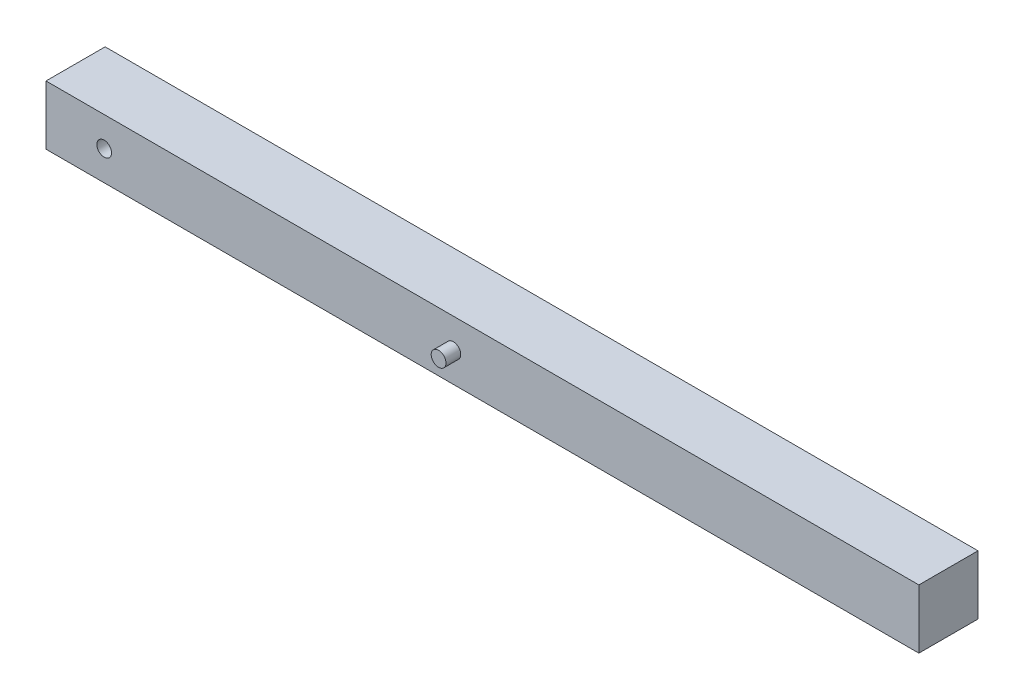
ISO-10303-21;
HEADER;
FILE_DESCRIPTION(('STEP AP214'),'2;1');
FILE_NAME('part.step','',(''),(''),'','','');
FILE_SCHEMA(('AUTOMOTIVE_DESIGN { 1 0 10303 214 1 1 1 1 }'));
ENDSEC;
DATA;
#1=APPLICATION_CONTEXT('core data for automotive mechanical design processes');
#2=APPLICATION_PROTOCOL_DEFINITION('international standard','automotive_design',2000,#1);
#3=PRODUCT_CONTEXT('',#1,'mechanical');
#4=PRODUCT('Part','Part','',(#3));
#5=PRODUCT_RELATED_PRODUCT_CATEGORY('part','',(#4));
#6=PRODUCT_DEFINITION_FORMATION('','',#4);
#7=PRODUCT_DEFINITION_CONTEXT('part definition',#1,'design');
#8=PRODUCT_DEFINITION('design','',#6,#7);
#9=PRODUCT_DEFINITION_SHAPE('','',#8);
#10=(LENGTH_UNIT() NAMED_UNIT(*) SI_UNIT(.MILLI.,.METRE.));
#11=(NAMED_UNIT(*) PLANE_ANGLE_UNIT() SI_UNIT($,.RADIAN.));
#12=(NAMED_UNIT(*) SI_UNIT($,.STERADIAN.) SOLID_ANGLE_UNIT());
#13=UNCERTAINTY_MEASURE_WITH_UNIT(LENGTH_MEASURE(1.E-05),#10,'distance_accuracy_value','');
#14=(GEOMETRIC_REPRESENTATION_CONTEXT(3) GLOBAL_UNCERTAINTY_ASSIGNED_CONTEXT((#13)) GLOBAL_UNIT_ASSIGNED_CONTEXT((#10,
#11,#12)) REPRESENTATION_CONTEXT('',''));
#15=CARTESIAN_POINT('',(0.,0.,0.));
#16=DIRECTION('',(0.,0.,1.));
#17=DIRECTION('',(1.,0.,0.));
#18=AXIS2_PLACEMENT_3D('',#15,#16,#17);
#19=CARTESIAN_POINT('',(0.,0.,50.8));
#20=DIRECTION('',(0.,0.,1.));
#21=DIRECTION('',(1.,0.,0.));
#22=AXIS2_PLACEMENT_3D('',#19,#20,#21);
#23=PLANE('',#22);
#24=CARTESIAN_POINT('',(10.6190502882642,-16.370527993747,50.8));
#25=DIRECTION('',(0.,0.,1.));
#26=DIRECTION('',(1.,0.,0.));
#27=AXIS2_PLACEMENT_3D('',#24,#25,#26);
#28=CIRCLE('',#27,6.35);
#29=CARTESIAN_POINT('',(16.9690502882642,-16.370527993747,50.8));
#30=VERTEX_POINT('',#29);
#31=EDGE_CURVE('E100',#30,#30,#28,.T.);
#32=ORIENTED_EDGE('',*,*,#31,.F.);
#33=EDGE_LOOP('',(#32));
#34=FACE_BOUND('',#33,.T.);
#35=DIRECTION('',(0.,-1.,0.));
#36=VECTOR('',#35,1.);
#37=CARTESIAN_POINT('',(-39.3809497117358,9.02947200625298,50.8));
#38=LINE('',#37,#36);
#39=CARTESIAN_POINT('',(-39.3809497117358,9.02947200625298,50.8));
#40=VERTEX_POINT('',#39);
#41=CARTESIAN_POINT('',(-39.3809497117358,-41.770527993747,50.8));
#42=VERTEX_POINT('',#41);
#43=EDGE_CURVE('E85',#40,#42,#38,.T.);
#44=ORIENTED_EDGE('',*,*,#43,.T.);
#45=DIRECTION('',(1.,0.,0.));
#46=VECTOR('',#45,1.);
#47=CARTESIAN_POINT('',(-39.3809497117358,-41.770527993747,50.8));
#48=LINE('',#47,#46);
#49=CARTESIAN_POINT('',(710.619050288264,-41.770527993747,50.8));
#50=VERTEX_POINT('',#49);
#51=EDGE_CURVE('E80',#42,#50,#48,.T.);
#52=ORIENTED_EDGE('',*,*,#51,.T.);
#53=DIRECTION('',(0.,1.,0.));
#54=VECTOR('',#53,1.);
#55=CARTESIAN_POINT('',(710.619050288264,9.02947200625298,50.8));
#56=LINE('',#55,#54);
#57=CARTESIAN_POINT('',(710.619050288264,9.02947200625298,50.8));
#58=VERTEX_POINT('',#57);
#59=EDGE_CURVE('E83',#50,#58,#56,.T.);
#60=ORIENTED_EDGE('',*,*,#59,.T.);
#61=DIRECTION('',(-1.,0.,0.));
#62=VECTOR('',#61,1.);
#63=CARTESIAN_POINT('',(-39.3809497117358,9.02947200625298,50.8));
#64=LINE('',#63,#62);
#65=EDGE_CURVE('E50',#58,#40,#64,.T.);
#66=ORIENTED_EDGE('',*,*,#65,.T.);
#67=EDGE_LOOP('',(#44,#52,#60,#66));
#68=FACE_BOUND('',#67,.T.);
#69=CARTESIAN_POINT('',(310.619050288264,-16.370527993747,50.8));
#70=DIRECTION('',(0.,0.,1.));
#71=DIRECTION('',(1.,0.,0.));
#72=AXIS2_PLACEMENT_3D('',#69,#70,#71);
#73=CIRCLE('',#72,6.34999999999999);
#74=CARTESIAN_POINT('',(316.969050288264,-16.370527993747,50.8));
#75=VERTEX_POINT('',#74);
#76=EDGE_CURVE('E118',#75,#75,#73,.T.);
#77=ORIENTED_EDGE('',*,*,#76,.F.);
#78=EDGE_LOOP('',(#77));
#79=FACE_BOUND('',#78,.T.);
#80=ADVANCED_FACE('F33',(#34,#68,#79),#23,.T.);
#81=CARTESIAN_POINT('',(0.,0.,0.));
#82=DIRECTION('',(0.,0.,1.));
#83=DIRECTION('',(1.,0.,0.));
#84=AXIS2_PLACEMENT_3D('',#81,#82,#83);
#85=PLANE('',#84);
#86=DIRECTION('',(0.,-1.,0.));
#87=VECTOR('',#86,1.);
#88=CARTESIAN_POINT('',(-39.3809497117358,9.02947200625298,0.));
#89=LINE('',#88,#87);
#90=CARTESIAN_POINT('',(-39.3809497117358,9.02947200625298,0.));
#91=VERTEX_POINT('',#90);
#92=CARTESIAN_POINT('',(-39.3809497117358,-41.770527993747,0.));
#93=VERTEX_POINT('',#92);
#94=EDGE_CURVE('E97',#91,#93,#89,.T.);
#95=ORIENTED_EDGE('',*,*,#94,.F.);
#96=DIRECTION('',(-1.,0.,0.));
#97=VECTOR('',#96,1.);
#98=CARTESIAN_POINT('',(-39.3809497117358,9.02947200625298,0.));
#99=LINE('',#98,#97);
#100=CARTESIAN_POINT('',(710.619050288264,9.02947200625298,0.));
#101=VERTEX_POINT('',#100);
#102=EDGE_CURVE('E73',#101,#91,#99,.T.);
#103=ORIENTED_EDGE('',*,*,#102,.F.);
#104=DIRECTION('',(0.,1.,0.));
#105=VECTOR('',#104,1.);
#106=CARTESIAN_POINT('',(710.619050288264,9.02947200625298,0.));
#107=LINE('',#106,#105);
#108=CARTESIAN_POINT('',(710.619050288264,-41.770527993747,0.));
#109=VERTEX_POINT('',#108);
#110=EDGE_CURVE('E67',#109,#101,#107,.T.);
#111=ORIENTED_EDGE('',*,*,#110,.F.);
#112=DIRECTION('',(1.,0.,0.));
#113=VECTOR('',#112,1.);
#114=CARTESIAN_POINT('',(-39.3809497117358,-41.770527993747,0.));
#115=LINE('',#114,#113);
#116=EDGE_CURVE('E89',#93,#109,#115,.T.);
#117=ORIENTED_EDGE('',*,*,#116,.F.);
#118=EDGE_LOOP('',(#95,#103,#111,#117));
#119=FACE_BOUND('',#118,.T.);
#120=CARTESIAN_POINT('',(10.6190502882642,-16.370527993747,0.));
#121=DIRECTION('',(0.,0.,1.));
#122=DIRECTION('',(1.,0.,0.));
#123=AXIS2_PLACEMENT_3D('',#120,#121,#122);
#124=CIRCLE('',#123,6.35);
#125=CARTESIAN_POINT('',(16.9690502882642,-16.370527993747,0.));
#126=VERTEX_POINT('',#125);
#127=EDGE_CURVE('E112',#126,#126,#124,.T.);
#128=ORIENTED_EDGE('',*,*,#127,.T.);
#129=EDGE_LOOP('',(#128));
#130=FACE_BOUND('',#129,.T.);
#131=ADVANCED_FACE('F108',(#119,#130),#85,.F.);
#132=CARTESIAN_POINT('',(-39.3809497117358,9.02947200625298,50.8));
#133=DIRECTION('',(1.,0.,0.));
#134=DIRECTION('',(0.,0.,-1.));
#135=AXIS2_PLACEMENT_3D('',#132,#133,#134);
#136=PLANE('',#135);
#137=ORIENTED_EDGE('',*,*,#94,.T.);
#138=DIRECTION('',(0.,0.,-1.));
#139=VECTOR('',#138,1.);
#140=CARTESIAN_POINT('',(-39.3809497117358,-41.770527993747,50.8));
#141=LINE('',#140,#139);
#142=EDGE_CURVE('E11',#42,#93,#141,.T.);
#143=ORIENTED_EDGE('',*,*,#142,.F.);
#144=ORIENTED_EDGE('',*,*,#43,.F.);
#145=DIRECTION('',(0.,0.,-1.));
#146=VECTOR('',#145,1.);
#147=CARTESIAN_POINT('',(-39.3809497117358,9.02947200625298,50.8));
#148=LINE('',#147,#146);
#149=EDGE_CURVE('E93',#40,#91,#148,.T.);
#150=ORIENTED_EDGE('',*,*,#149,.T.);
#151=EDGE_LOOP('',(#137,#143,#144,#150));
#152=FACE_BOUND('',#151,.T.);
#153=ADVANCED_FACE('F35',(#152),#136,.F.);
#154=CARTESIAN_POINT('',(-39.3809497117358,-41.770527993747,50.8));
#155=DIRECTION('',(0.,1.,0.));
#156=DIRECTION('',(0.,0.,1.));
#157=AXIS2_PLACEMENT_3D('',#154,#155,#156);
#158=PLANE('',#157);
#159=ORIENTED_EDGE('',*,*,#116,.T.);
#160=DIRECTION('',(0.,0.,-1.));
#161=VECTOR('',#160,1.);
#162=CARTESIAN_POINT('',(710.619050288264,-41.770527993747,50.8));
#163=LINE('',#162,#161);
#164=EDGE_CURVE('E42',#50,#109,#163,.T.);
#165=ORIENTED_EDGE('',*,*,#164,.F.);
#166=ORIENTED_EDGE('',*,*,#51,.F.);
#167=ORIENTED_EDGE('',*,*,#142,.T.);
#168=EDGE_LOOP('',(#159,#165,#166,#167));
#169=FACE_BOUND('',#168,.T.);
#170=ADVANCED_FACE('F88',(#169),#158,.F.);
#171=CARTESIAN_POINT('',(710.619050288264,9.02947200625298,50.8));
#172=DIRECTION('',(-1.,0.,0.));
#173=DIRECTION('',(0.,0.,1.));
#174=AXIS2_PLACEMENT_3D('',#171,#172,#173);
#175=PLANE('',#174);
#176=ORIENTED_EDGE('',*,*,#110,.T.);
#177=DIRECTION('',(0.,0.,-1.));
#178=VECTOR('',#177,1.);
#179=CARTESIAN_POINT('',(710.619050288264,9.02947200625298,50.8));
#180=LINE('',#179,#178);
#181=EDGE_CURVE('E90',#58,#101,#180,.T.);
#182=ORIENTED_EDGE('',*,*,#181,.F.);
#183=ORIENTED_EDGE('',*,*,#59,.F.);
#184=ORIENTED_EDGE('',*,*,#164,.T.);
#185=EDGE_LOOP('',(#176,#182,#183,#184));
#186=FACE_BOUND('',#185,.T.);
#187=ADVANCED_FACE('F91',(#186),#175,.F.);
#188=CARTESIAN_POINT('',(-39.3809497117358,9.02947200625298,50.8));
#189=DIRECTION('',(0.,-1.,0.));
#190=DIRECTION('',(0.,0.,-1.));
#191=AXIS2_PLACEMENT_3D('',#188,#189,#190);
#192=PLANE('',#191);
#193=ORIENTED_EDGE('',*,*,#102,.T.);
#194=ORIENTED_EDGE('',*,*,#149,.F.);
#195=ORIENTED_EDGE('',*,*,#65,.F.);
#196=ORIENTED_EDGE('',*,*,#181,.T.);
#197=EDGE_LOOP('',(#193,#194,#195,#196));
#198=FACE_BOUND('',#197,.T.);
#199=ADVANCED_FACE('F105',(#198),#192,.F.);
#200=CARTESIAN_POINT('',(10.6190502882642,-16.370527993747,50.8));
#201=DIRECTION('',(0.,0.,-1.));
#202=DIRECTION('',(-1.,0.,0.));
#203=AXIS2_PLACEMENT_3D('',#200,#201,#202);
#204=CYLINDRICAL_SURFACE('',#203,6.35);
#205=ORIENTED_EDGE('',*,*,#31,.T.);
#206=EDGE_LOOP('',(#205));
#207=FACE_BOUND('',#206,.T.);
#208=ORIENTED_EDGE('',*,*,#127,.F.);
#209=EDGE_LOOP('',(#208));
#210=FACE_BOUND('',#209,.T.);
#211=ADVANCED_FACE('F129',(#207,#210),#204,.F.);
#212=CARTESIAN_POINT('',(310.619050288264,-16.370527993747,63.5));
#213=DIRECTION('',(0.,0.,-1.));
#214=DIRECTION('',(-1.,0.,0.));
#215=AXIS2_PLACEMENT_3D('',#212,#213,#214);
#216=CYLINDRICAL_SURFACE('',#215,6.34999999999999);
#217=CARTESIAN_POINT('',(310.619050288264,-16.370527993747,63.5));
#218=DIRECTION('',(0.,0.,1.));
#219=DIRECTION('',(1.,0.,0.));
#220=AXIS2_PLACEMENT_3D('',#217,#218,#219);
#221=CIRCLE('',#220,6.34999999999999);
#222=CARTESIAN_POINT('',(316.969050288264,-16.370527993747,63.5));
#223=VERTEX_POINT('',#222);
#224=EDGE_CURVE('E115',#223,#223,#221,.T.);
#225=ORIENTED_EDGE('',*,*,#224,.F.);
#226=EDGE_LOOP('',(#225));
#227=FACE_BOUND('',#226,.T.);
#228=ORIENTED_EDGE('',*,*,#76,.T.);
#229=EDGE_LOOP('',(#228));
#230=FACE_BOUND('',#229,.T.);
#231=ADVANCED_FACE('F126',(#227,#230),#216,.T.);
#232=CARTESIAN_POINT('',(310.619050288264,-16.370527993747,63.5));
#233=DIRECTION('',(0.,0.,1.));
#234=DIRECTION('',(1.,0.,0.));
#235=AXIS2_PLACEMENT_3D('',#232,#233,#234);
#236=PLANE('',#235);
#237=ORIENTED_EDGE('',*,*,#224,.T.);
#238=EDGE_LOOP('',(#237));
#239=FACE_BOUND('',#238,.T.);
#240=ADVANCED_FACE('F124',(#239),#236,.T.);
#241=CLOSED_SHELL('',(#80,#131,#153,#170,#187,#199,#211,#231,#240));
#242=MANIFOLD_SOLID_BREP('B2',#241);
#243=ADVANCED_BREP_SHAPE_REPRESENTATION('',(#18,#242),#14);
#244=SHAPE_DEFINITION_REPRESENTATION(#9,#243);
ENDSEC;
END-ISO-10303-21;
